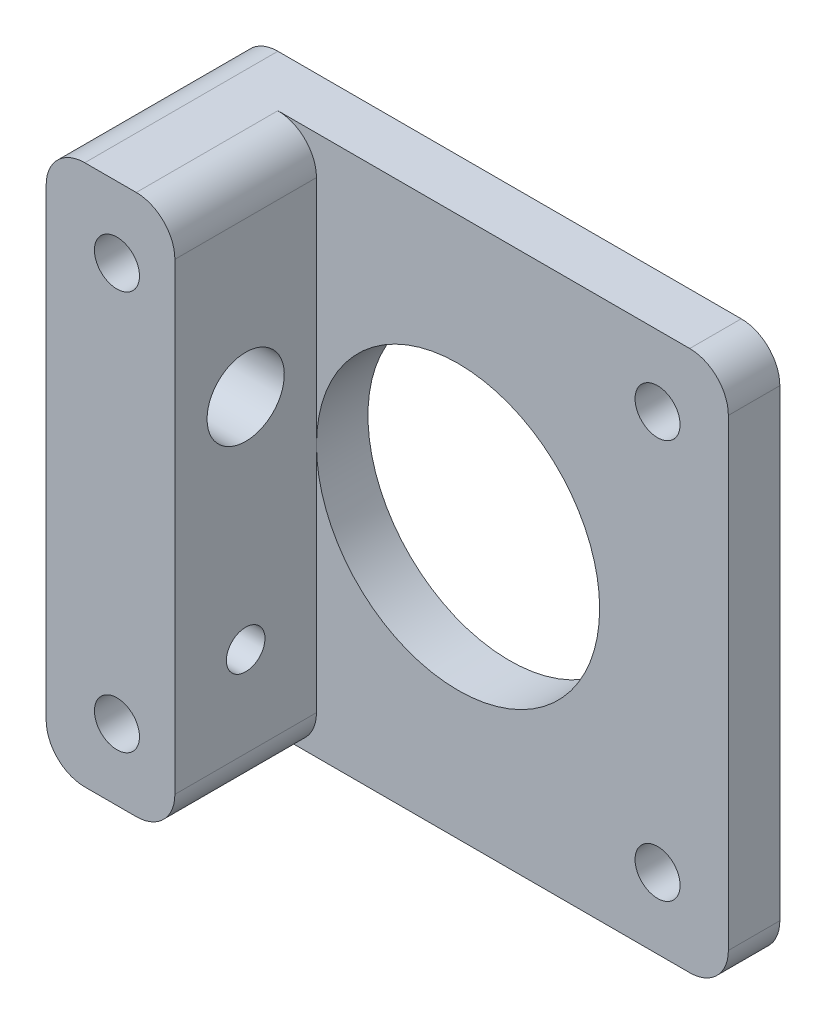
ISO-10303-21;
HEADER;
FILE_DESCRIPTION(('STEP AP214'),'2;1');
FILE_NAME('part.step','',(''),(''),'','','');
FILE_SCHEMA(('AUTOMOTIVE_DESIGN { 1 0 10303 214 1 1 1 1 }'));
ENDSEC;
DATA;
#1=APPLICATION_CONTEXT('core data for automotive mechanical design processes');
#2=APPLICATION_PROTOCOL_DEFINITION('international standard','automotive_design',2000,#1);
#3=PRODUCT_CONTEXT('',#1,'mechanical');
#4=PRODUCT('Part','Part','',(#3));
#5=PRODUCT_RELATED_PRODUCT_CATEGORY('part','',(#4));
#6=PRODUCT_DEFINITION_FORMATION('','',#4);
#7=PRODUCT_DEFINITION_CONTEXT('part definition',#1,'design');
#8=PRODUCT_DEFINITION('design','',#6,#7);
#9=PRODUCT_DEFINITION_SHAPE('','',#8);
#10=(LENGTH_UNIT() NAMED_UNIT(*) SI_UNIT(.MILLI.,.METRE.));
#11=(NAMED_UNIT(*) PLANE_ANGLE_UNIT() SI_UNIT($,.RADIAN.));
#12=(NAMED_UNIT(*) SI_UNIT($,.STERADIAN.) SOLID_ANGLE_UNIT());
#13=UNCERTAINTY_MEASURE_WITH_UNIT(LENGTH_MEASURE(1.E-05),#10,'distance_accuracy_value','');
#14=(GEOMETRIC_REPRESENTATION_CONTEXT(3) GLOBAL_UNCERTAINTY_ASSIGNED_CONTEXT((#13)) GLOBAL_UNIT_ASSIGNED_CONTEXT((#10,
#11,#12)) REPRESENTATION_CONTEXT('',''));
#15=CARTESIAN_POINT('',(0.,0.,0.));
#16=DIRECTION('',(0.,0.,1.));
#17=DIRECTION('',(1.,0.,0.));
#18=AXIS2_PLACEMENT_3D('',#15,#16,#17);
#19=CARTESIAN_POINT('',(21.,21.,4.));
#20=DIRECTION('',(-1.,0.,0.));
#21=DIRECTION('',(0.,-1.,0.));
#22=AXIS2_PLACEMENT_3D('',#19,#20,#21);
#23=PLANE('',#22);
#24=DIRECTION('',(0.,1.,0.));
#25=VECTOR('',#24,1.);
#26=CARTESIAN_POINT('',(21.,21.,0.));
#27=LINE('',#26,#25);
#28=CARTESIAN_POINT('',(21.,-18.,0.));
#29=VERTEX_POINT('',#28);
#30=CARTESIAN_POINT('',(21.,18.,0.));
#31=VERTEX_POINT('',#30);
#32=EDGE_CURVE('E166',#29,#31,#27,.T.);
#33=ORIENTED_EDGE('',*,*,#32,.T.);
#34=DIRECTION('',(0.,0.,-1.));
#35=VECTOR('',#34,1.);
#36=CARTESIAN_POINT('',(21.,18.,4.));
#37=LINE('',#36,#35);
#38=CARTESIAN_POINT('',(21.,18.,4.));
#39=VERTEX_POINT('',#38);
#40=EDGE_CURVE('E50',#31,#39,#37,.F.);
#41=ORIENTED_EDGE('',*,*,#40,.T.);
#42=DIRECTION('',(0.,1.,0.));
#43=VECTOR('',#42,1.);
#44=CARTESIAN_POINT('',(21.,21.,4.));
#45=LINE('',#44,#43);
#46=CARTESIAN_POINT('',(21.,-18.,4.));
#47=VERTEX_POINT('',#46);
#48=EDGE_CURVE('E168',#47,#39,#45,.T.);
#49=ORIENTED_EDGE('',*,*,#48,.F.);
#50=DIRECTION('',(0.,0.,-1.));
#51=VECTOR('',#50,1.);
#52=CARTESIAN_POINT('',(21.,-18.,4.));
#53=LINE('',#52,#51);
#54=EDGE_CURVE('E218',#47,#29,#53,.T.);
#55=ORIENTED_EDGE('',*,*,#54,.T.);
#56=EDGE_LOOP('',(#33,#41,#49,#55));
#57=FACE_BOUND('',#56,.T.);
#58=ADVANCED_FACE('F33',(#57),#23,.F.);
#59=CARTESIAN_POINT('',(-21.,21.,4.));
#60=DIRECTION('',(0.,-1.,0.));
#61=DIRECTION('',(0.,0.,-1.));
#62=AXIS2_PLACEMENT_3D('',#59,#60,#61);
#63=PLANE('',#62);
#64=DIRECTION('',(-1.,0.,0.));
#65=VECTOR('',#64,1.);
#66=CARTESIAN_POINT('',(-21.,21.,15.));
#67=LINE('',#66,#65);
#68=CARTESIAN_POINT('',(-14.,21.,15.));
#69=VERTEX_POINT('',#68);
#70=CARTESIAN_POINT('',(-18.,21.,15.));
#71=VERTEX_POINT('',#70);
#72=EDGE_CURVE('E164',#69,#71,#67,.T.);
#73=ORIENTED_EDGE('',*,*,#72,.F.);
#74=DIRECTION('',(0.,0.,-1.));
#75=VECTOR('',#74,1.);
#76=CARTESIAN_POINT('',(-14.,21.,4.));
#77=LINE('',#76,#75);
#78=CARTESIAN_POINT('',(-14.,21.,4.));
#79=VERTEX_POINT('',#78);
#80=EDGE_CURVE('E189',#69,#79,#77,.T.);
#81=ORIENTED_EDGE('',*,*,#80,.T.);
#82=DIRECTION('',(-1.,0.,0.));
#83=VECTOR('',#82,1.);
#84=CARTESIAN_POINT('',(-21.,21.,4.));
#85=LINE('',#84,#83);
#86=CARTESIAN_POINT('',(18.,21.,4.));
#87=VERTEX_POINT('',#86);
#88=EDGE_CURVE('E170',#87,#79,#85,.T.);
#89=ORIENTED_EDGE('',*,*,#88,.F.);
#90=DIRECTION('',(0.,0.,-1.));
#91=VECTOR('',#90,1.);
#92=CARTESIAN_POINT('',(18.,21.,4.));
#93=LINE('',#92,#91);
#94=CARTESIAN_POINT('',(18.,21.,0.));
#95=VERTEX_POINT('',#94);
#96=EDGE_CURVE('E186',#87,#95,#93,.T.);
#97=ORIENTED_EDGE('',*,*,#96,.T.);
#98=DIRECTION('',(-1.,0.,0.));
#99=VECTOR('',#98,1.);
#100=CARTESIAN_POINT('',(-21.,21.,0.));
#101=LINE('',#100,#99);
#102=CARTESIAN_POINT('',(-18.,21.,0.));
#103=VERTEX_POINT('',#102);
#104=EDGE_CURVE('E177',#95,#103,#101,.T.);
#105=ORIENTED_EDGE('',*,*,#104,.T.);
#106=DIRECTION('',(0.,0.,-1.));
#107=VECTOR('',#106,1.);
#108=CARTESIAN_POINT('',(-18.,21.,4.));
#109=LINE('',#108,#107);
#110=EDGE_CURVE('E175',#103,#71,#109,.F.);
#111=ORIENTED_EDGE('',*,*,#110,.T.);
#112=EDGE_LOOP('',(#73,#81,#89,#97,#105,#111));
#113=FACE_BOUND('',#112,.T.);
#114=ADVANCED_FACE('F282',(#113),#63,.F.);
#115=CARTESIAN_POINT('',(-21.,21.,4.));
#116=DIRECTION('',(1.,0.,0.));
#117=DIRECTION('',(0.,0.,-1.));
#118=AXIS2_PLACEMENT_3D('',#115,#116,#117);
#119=PLANE('',#118);
#120=CARTESIAN_POINT('',(-21.,6.00000000000001,9.5));
#121=DIRECTION('',(-1.,0.,0.));
#122=DIRECTION('',(0.,0.,1.));
#123=AXIS2_PLACEMENT_3D('',#120,#121,#122);
#124=CIRCLE('',#123,3.);
#125=CARTESIAN_POINT('',(-21.,6.00000000000001,12.5));
#126=VERTEX_POINT('',#125);
#127=EDGE_CURVE('E239',#126,#126,#124,.T.);
#128=ORIENTED_EDGE('',*,*,#127,.F.);
#129=EDGE_LOOP('',(#128));
#130=FACE_BOUND('',#129,.T.);
#131=CARTESIAN_POINT('',(-21.,-11.,9.5));
#132=DIRECTION('',(-1.,0.,0.));
#133=DIRECTION('',(0.,0.,1.));
#134=AXIS2_PLACEMENT_3D('',#131,#132,#133);
#135=CIRCLE('',#134,1.5);
#136=CARTESIAN_POINT('',(-21.,-11.,11.));
#137=VERTEX_POINT('',#136);
#138=EDGE_CURVE('E245',#137,#137,#135,.T.);
#139=ORIENTED_EDGE('',*,*,#138,.F.);
#140=EDGE_LOOP('',(#139));
#141=FACE_BOUND('',#140,.T.);
#142=DIRECTION('',(0.,-1.,0.));
#143=VECTOR('',#142,1.);
#144=CARTESIAN_POINT('',(-21.,21.,15.));
#145=LINE('',#144,#143);
#146=CARTESIAN_POINT('',(-21.,18.,15.));
#147=VERTEX_POINT('',#146);
#148=CARTESIAN_POINT('',(-21.,-18.,15.));
#149=VERTEX_POINT('',#148);
#150=EDGE_CURVE('E140',#147,#149,#145,.T.);
#151=ORIENTED_EDGE('',*,*,#150,.F.);
#152=DIRECTION('',(0.,0.,-1.));
#153=VECTOR('',#152,1.);
#154=CARTESIAN_POINT('',(-21.,18.,4.));
#155=LINE('',#154,#153);
#156=CARTESIAN_POINT('',(-21.,18.,0.));
#157=VERTEX_POINT('',#156);
#158=EDGE_CURVE('E227',#147,#157,#155,.T.);
#159=ORIENTED_EDGE('',*,*,#158,.T.);
#160=DIRECTION('',(0.,-1.,0.));
#161=VECTOR('',#160,1.);
#162=CARTESIAN_POINT('',(-21.,21.,0.));
#163=LINE('',#162,#161);
#164=CARTESIAN_POINT('',(-21.,-18.,0.));
#165=VERTEX_POINT('',#164);
#166=EDGE_CURVE('E180',#157,#165,#163,.T.);
#167=ORIENTED_EDGE('',*,*,#166,.T.);
#168=DIRECTION('',(0.,0.,-1.));
#169=VECTOR('',#168,1.);
#170=CARTESIAN_POINT('',(-21.,-18.,4.));
#171=LINE('',#170,#169);
#172=EDGE_CURVE('E225',#165,#149,#171,.F.);
#173=ORIENTED_EDGE('',*,*,#172,.T.);
#174=EDGE_LOOP('',(#151,#159,#167,#173));
#175=FACE_BOUND('',#174,.T.);
#176=ADVANCED_FACE('F293',(#130,#141,#175),#119,.F.);
#177=CARTESIAN_POINT('',(-21.,-21.,4.));
#178=DIRECTION('',(0.,1.,0.));
#179=DIRECTION('',(0.,0.,1.));
#180=AXIS2_PLACEMENT_3D('',#177,#178,#179);
#181=PLANE('',#180);
#182=DIRECTION('',(1.,0.,0.));
#183=VECTOR('',#182,1.);
#184=CARTESIAN_POINT('',(-21.,-21.,4.));
#185=LINE('',#184,#183);
#186=CARTESIAN_POINT('',(-14.,-21.,4.));
#187=VERTEX_POINT('',#186);
#188=CARTESIAN_POINT('',(18.,-21.,4.));
#189=VERTEX_POINT('',#188);
#190=EDGE_CURVE('E173',#187,#189,#185,.T.);
#191=ORIENTED_EDGE('',*,*,#190,.F.);
#192=DIRECTION('',(0.,0.,-1.));
#193=VECTOR('',#192,1.);
#194=CARTESIAN_POINT('',(-14.,-21.,4.));
#195=LINE('',#194,#193);
#196=CARTESIAN_POINT('',(-14.,-21.,15.));
#197=VERTEX_POINT('',#196);
#198=EDGE_CURVE('E208',#187,#197,#195,.F.);
#199=ORIENTED_EDGE('',*,*,#198,.T.);
#200=DIRECTION('',(1.,0.,0.));
#201=VECTOR('',#200,1.);
#202=CARTESIAN_POINT('',(-21.,-21.,15.));
#203=LINE('',#202,#201);
#204=CARTESIAN_POINT('',(-18.,-21.,15.));
#205=VERTEX_POINT('',#204);
#206=EDGE_CURVE('E158',#205,#197,#203,.T.);
#207=ORIENTED_EDGE('',*,*,#206,.F.);
#208=DIRECTION('',(0.,0.,-1.));
#209=VECTOR('',#208,1.);
#210=CARTESIAN_POINT('',(-18.,-21.,4.));
#211=LINE('',#210,#209);
#212=CARTESIAN_POINT('',(-18.,-21.,0.));
#213=VERTEX_POINT('',#212);
#214=EDGE_CURVE('E203',#205,#213,#211,.T.);
#215=ORIENTED_EDGE('',*,*,#214,.T.);
#216=DIRECTION('',(1.,0.,0.));
#217=VECTOR('',#216,1.);
#218=CARTESIAN_POINT('',(-21.,-21.,0.));
#219=LINE('',#218,#217);
#220=CARTESIAN_POINT('',(18.,-21.,0.));
#221=VERTEX_POINT('',#220);
#222=EDGE_CURVE('E171',#213,#221,#219,.T.);
#223=ORIENTED_EDGE('',*,*,#222,.T.);
#224=DIRECTION('',(0.,0.,-1.));
#225=VECTOR('',#224,1.);
#226=CARTESIAN_POINT('',(18.,-21.,4.));
#227=LINE('',#226,#225);
#228=EDGE_CURVE('E206',#221,#189,#227,.F.);
#229=ORIENTED_EDGE('',*,*,#228,.T.);
#230=EDGE_LOOP('',(#191,#199,#207,#215,#223,#229));
#231=FACE_BOUND('',#230,.T.);
#232=ADVANCED_FACE('F270',(#231),#181,.F.);
#233=CARTESIAN_POINT('',(0.,0.,4.));
#234=DIRECTION('',(0.,0.,1.));
#235=DIRECTION('',(1.,0.,0.));
#236=AXIS2_PLACEMENT_3D('',#233,#234,#235);
#237=PLANE('',#236);
#238=CARTESIAN_POINT('',(15.5,15.5,4.));
#239=DIRECTION('',(0.,0.,1.));
#240=DIRECTION('',(1.,0.,0.));
#241=AXIS2_PLACEMENT_3D('',#238,#239,#240);
#242=CIRCLE('',#241,1.75);
#243=CARTESIAN_POINT('',(17.25,15.5,4.));
#244=VERTEX_POINT('',#243);
#245=EDGE_CURVE('E147',#244,#244,#242,.T.);
#246=ORIENTED_EDGE('',*,*,#245,.F.);
#247=EDGE_LOOP('',(#246));
#248=FACE_BOUND('',#247,.T.);
#249=CARTESIAN_POINT('',(15.5,-15.5,4.));
#250=DIRECTION('',(0.,0.,1.));
#251=DIRECTION('',(1.,0.,0.));
#252=AXIS2_PLACEMENT_3D('',#249,#250,#251);
#253=CIRCLE('',#252,1.75);
#254=CARTESIAN_POINT('',(17.25,-15.5,4.));
#255=VERTEX_POINT('',#254);
#256=EDGE_CURVE('E234',#255,#255,#253,.T.);
#257=ORIENTED_EDGE('',*,*,#256,.F.);
#258=EDGE_LOOP('',(#257));
#259=FACE_BOUND('',#258,.T.);
#260=ORIENTED_EDGE('',*,*,#48,.T.);
#261=CARTESIAN_POINT('',(18.,18.,4.));
#262=DIRECTION('',(0.,0.,1.));
#263=DIRECTION('',(1.,0.,0.));
#264=AXIS2_PLACEMENT_3D('',#261,#262,#263);
#265=CIRCLE('',#264,3.);
#266=EDGE_CURVE('E223',#39,#87,#265,.T.);
#267=ORIENTED_EDGE('',*,*,#266,.T.);
#268=ORIENTED_EDGE('',*,*,#88,.T.);
#269=CARTESIAN_POINT('',(-14.,18.,4.));
#270=DIRECTION('',(0.,0.,1.));
#271=DIRECTION('',(1.,0.,0.));
#272=AXIS2_PLACEMENT_3D('',#269,#270,#271);
#273=CIRCLE('',#272,3.);
#274=CARTESIAN_POINT('',(-11.,18.,4.));
#275=VERTEX_POINT('',#274);
#276=EDGE_CURVE('E42',#79,#275,#273,.F.);
#277=ORIENTED_EDGE('',*,*,#276,.T.);
#278=DIRECTION('',(0.,1.,0.));
#279=VECTOR('',#278,1.);
#280=CARTESIAN_POINT('',(-11.,21.,4.));
#281=LINE('',#280,#279);
#282=CARTESIAN_POINT('',(-11.,0.,4.));
#283=VERTEX_POINT('',#282);
#284=EDGE_CURVE('E134',#283,#275,#281,.T.);
#285=ORIENTED_EDGE('',*,*,#284,.F.);
#286=CARTESIAN_POINT('',(0.,0.,4.));
#287=DIRECTION('',(0.,0.,1.));
#288=DIRECTION('',(1.,0.,0.));
#289=AXIS2_PLACEMENT_3D('',#286,#287,#288);
#290=CIRCLE('',#289,11.);
#291=EDGE_CURVE('E143',#283,#283,#290,.T.);
#292=ORIENTED_EDGE('',*,*,#291,.F.);
#293=CARTESIAN_POINT('',(-11.,-18.,4.));
#294=VERTEX_POINT('',#293);
#295=EDGE_CURVE('E130',#294,#283,#281,.T.);
#296=ORIENTED_EDGE('',*,*,#295,.F.);
#297=CARTESIAN_POINT('',(-14.,-18.,4.));
#298=DIRECTION('',(0.,0.,1.));
#299=DIRECTION('',(1.,0.,0.));
#300=AXIS2_PLACEMENT_3D('',#297,#298,#299);
#301=CIRCLE('',#300,3.);
#302=EDGE_CURVE('E11',#294,#187,#301,.F.);
#303=ORIENTED_EDGE('',*,*,#302,.T.);
#304=ORIENTED_EDGE('',*,*,#190,.T.);
#305=CARTESIAN_POINT('',(18.,-18.,4.));
#306=DIRECTION('',(0.,0.,1.));
#307=DIRECTION('',(1.,0.,0.));
#308=AXIS2_PLACEMENT_3D('',#305,#306,#307);
#309=CIRCLE('',#308,3.);
#310=EDGE_CURVE('E57',#189,#47,#309,.T.);
#311=ORIENTED_EDGE('',*,*,#310,.T.);
#312=EDGE_LOOP('',(#260,#267,#268,#277,#285,#292,#296,#303,#304,#311));
#313=FACE_BOUND('',#312,.T.);
#314=ADVANCED_FACE('F267',(#248,#259,#313),#237,.T.);
#315=CARTESIAN_POINT('',(0.,0.,0.));
#316=DIRECTION('',(0.,0.,1.));
#317=DIRECTION('',(1.,0.,0.));
#318=AXIS2_PLACEMENT_3D('',#315,#316,#317);
#319=PLANE('',#318);
#320=CARTESIAN_POINT('',(-15.5,-15.5,0.));
#321=DIRECTION('',(0.,0.,1.));
#322=DIRECTION('',(1.,0.,0.));
#323=AXIS2_PLACEMENT_3D('',#320,#321,#322);
#324=CIRCLE('',#323,1.75);
#325=CARTESIAN_POINT('',(-13.75,-15.5,0.));
#326=VERTEX_POINT('',#325);
#327=EDGE_CURVE('E235',#326,#326,#324,.T.);
#328=ORIENTED_EDGE('',*,*,#327,.T.);
#329=EDGE_LOOP('',(#328));
#330=FACE_BOUND('',#329,.T.);
#331=CARTESIAN_POINT('',(15.5,15.5,0.));
#332=DIRECTION('',(0.,0.,1.));
#333=DIRECTION('',(1.,0.,0.));
#334=AXIS2_PLACEMENT_3D('',#331,#332,#333);
#335=CIRCLE('',#334,1.75);
#336=CARTESIAN_POINT('',(17.25,15.5,0.));
#337=VERTEX_POINT('',#336);
#338=EDGE_CURVE('E152',#337,#337,#335,.T.);
#339=ORIENTED_EDGE('',*,*,#338,.T.);
#340=EDGE_LOOP('',(#339));
#341=FACE_BOUND('',#340,.T.);
#342=CARTESIAN_POINT('',(15.5,-15.5,0.));
#343=DIRECTION('',(0.,0.,1.));
#344=DIRECTION('',(1.,0.,0.));
#345=AXIS2_PLACEMENT_3D('',#342,#343,#344);
#346=CIRCLE('',#345,1.75);
#347=CARTESIAN_POINT('',(17.25,-15.5,0.));
#348=VERTEX_POINT('',#347);
#349=EDGE_CURVE('E231',#348,#348,#346,.T.);
#350=ORIENTED_EDGE('',*,*,#349,.T.);
#351=EDGE_LOOP('',(#350));
#352=FACE_BOUND('',#351,.T.);
#353=CARTESIAN_POINT('',(-15.5,15.5,0.));
#354=DIRECTION('',(0.,0.,1.));
#355=DIRECTION('',(1.,0.,0.));
#356=AXIS2_PLACEMENT_3D('',#353,#354,#355);
#357=CIRCLE('',#356,1.75);
#358=CARTESIAN_POINT('',(-13.75,15.5,0.));
#359=VERTEX_POINT('',#358);
#360=EDGE_CURVE('E257',#359,#359,#357,.T.);
#361=ORIENTED_EDGE('',*,*,#360,.T.);
#362=EDGE_LOOP('',(#361));
#363=FACE_BOUND('',#362,.T.);
#364=CARTESIAN_POINT('',(0.,0.,0.));
#365=DIRECTION('',(0.,0.,1.));
#366=DIRECTION('',(1.,0.,0.));
#367=AXIS2_PLACEMENT_3D('',#364,#365,#366);
#368=CIRCLE('',#367,11.);
#369=CARTESIAN_POINT('',(11.,0.,0.));
#370=VERTEX_POINT('',#369);
#371=EDGE_CURVE('E146',#370,#370,#368,.T.);
#372=ORIENTED_EDGE('',*,*,#371,.T.);
#373=EDGE_LOOP('',(#372));
#374=FACE_BOUND('',#373,.T.);
#375=ORIENTED_EDGE('',*,*,#104,.F.);
#376=CARTESIAN_POINT('',(18.,18.,0.));
#377=DIRECTION('',(0.,0.,1.));
#378=DIRECTION('',(1.,0.,0.));
#379=AXIS2_PLACEMENT_3D('',#376,#377,#378);
#380=CIRCLE('',#379,3.);
#381=EDGE_CURVE('E216',#95,#31,#380,.F.);
#382=ORIENTED_EDGE('',*,*,#381,.T.);
#383=ORIENTED_EDGE('',*,*,#32,.F.);
#384=CARTESIAN_POINT('',(18.,-18.,0.));
#385=DIRECTION('',(0.,0.,1.));
#386=DIRECTION('',(1.,0.,0.));
#387=AXIS2_PLACEMENT_3D('',#384,#385,#386);
#388=CIRCLE('',#387,3.);
#389=EDGE_CURVE('E212',#29,#221,#388,.F.);
#390=ORIENTED_EDGE('',*,*,#389,.T.);
#391=ORIENTED_EDGE('',*,*,#222,.F.);
#392=CARTESIAN_POINT('',(-18.,-18.,0.));
#393=DIRECTION('',(0.,0.,1.));
#394=DIRECTION('',(1.,0.,0.));
#395=AXIS2_PLACEMENT_3D('',#392,#393,#394);
#396=CIRCLE('',#395,3.);
#397=EDGE_CURVE('E210',#213,#165,#396,.F.);
#398=ORIENTED_EDGE('',*,*,#397,.T.);
#399=ORIENTED_EDGE('',*,*,#166,.F.);
#400=CARTESIAN_POINT('',(-18.,18.,0.));
#401=DIRECTION('',(0.,0.,1.));
#402=DIRECTION('',(1.,0.,0.));
#403=AXIS2_PLACEMENT_3D('',#400,#401,#402);
#404=CIRCLE('',#403,3.);
#405=EDGE_CURVE('E214',#157,#103,#404,.F.);
#406=ORIENTED_EDGE('',*,*,#405,.T.);
#407=EDGE_LOOP('',(#375,#382,#383,#390,#391,#398,#399,#406));
#408=FACE_BOUND('',#407,.T.);
#409=ADVANCED_FACE('F269',(#330,#341,#352,#363,#374,#408),#319,.F.);
#410=CARTESIAN_POINT('',(-11.,21.,15.));
#411=DIRECTION('',(-1.,0.,0.));
#412=DIRECTION('',(0.,-1.,0.));
#413=AXIS2_PLACEMENT_3D('',#410,#411,#412);
#414=PLANE('',#413);
#415=CARTESIAN_POINT('',(-11.,6.00000000000001,9.5));
#416=DIRECTION('',(-1.,0.,0.));
#417=DIRECTION('',(0.,-1.,0.));
#418=AXIS2_PLACEMENT_3D('',#415,#416,#417);
#419=CIRCLE('',#418,3.);
#420=CARTESIAN_POINT('',(-11.,3.,9.5));
#421=VERTEX_POINT('',#420);
#422=EDGE_CURVE('E37',#421,#421,#419,.T.);
#423=ORIENTED_EDGE('',*,*,#422,.T.);
#424=EDGE_LOOP('',(#423));
#425=FACE_BOUND('',#424,.T.);
#426=CARTESIAN_POINT('',(-11.,-11.,9.5));
#427=DIRECTION('',(-1.,0.,0.));
#428=DIRECTION('',(0.,-1.,0.));
#429=AXIS2_PLACEMENT_3D('',#426,#427,#428);
#430=CIRCLE('',#429,1.5);
#431=CARTESIAN_POINT('',(-11.,-12.5,9.5));
#432=VERTEX_POINT('',#431);
#433=EDGE_CURVE('E237',#432,#432,#430,.T.);
#434=ORIENTED_EDGE('',*,*,#433,.T.);
#435=EDGE_LOOP('',(#434));
#436=FACE_BOUND('',#435,.T.);
#437=ORIENTED_EDGE('',*,*,#284,.T.);
#438=DIRECTION('',(0.,0.,-1.));
#439=VECTOR('',#438,1.);
#440=CARTESIAN_POINT('',(-11.,18.,15.));
#441=LINE('',#440,#439);
#442=CARTESIAN_POINT('',(-11.,18.,15.));
#443=VERTEX_POINT('',#442);
#444=EDGE_CURVE('E193',#275,#443,#441,.F.);
#445=ORIENTED_EDGE('',*,*,#444,.T.);
#446=DIRECTION('',(0.,1.,0.));
#447=VECTOR('',#446,1.);
#448=CARTESIAN_POINT('',(-11.,21.,15.));
#449=LINE('',#448,#447);
#450=CARTESIAN_POINT('',(-11.,-18.,15.));
#451=VERTEX_POINT('',#450);
#452=EDGE_CURVE('E161',#451,#443,#449,.T.);
#453=ORIENTED_EDGE('',*,*,#452,.F.);
#454=DIRECTION('',(0.,0.,-1.));
#455=VECTOR('',#454,1.);
#456=CARTESIAN_POINT('',(-11.,-18.,15.));
#457=LINE('',#456,#455);
#458=EDGE_CURVE('E138',#451,#294,#457,.T.);
#459=ORIENTED_EDGE('',*,*,#458,.T.);
#460=ORIENTED_EDGE('',*,*,#295,.T.);
#461=EDGE_LOOP('',(#437,#445,#453,#459,#460));
#462=FACE_BOUND('',#461,.T.);
#463=ADVANCED_FACE('F132',(#425,#436,#462),#414,.F.);
#464=CARTESIAN_POINT('',(0.,0.,15.));
#465=DIRECTION('',(0.,0.,1.));
#466=DIRECTION('',(1.,0.,0.));
#467=AXIS2_PLACEMENT_3D('',#464,#465,#466);
#468=PLANE('',#467);
#469=CARTESIAN_POINT('',(-15.5,-15.5,15.));
#470=DIRECTION('',(0.,0.,1.));
#471=DIRECTION('',(1.,0.,0.));
#472=AXIS2_PLACEMENT_3D('',#469,#470,#471);
#473=CIRCLE('',#472,1.75);
#474=CARTESIAN_POINT('',(-13.75,-15.5,15.));
#475=VERTEX_POINT('',#474);
#476=EDGE_CURVE('E243',#475,#475,#473,.T.);
#477=ORIENTED_EDGE('',*,*,#476,.F.);
#478=EDGE_LOOP('',(#477));
#479=FACE_BOUND('',#478,.T.);
#480=CARTESIAN_POINT('',(-15.5,15.5,15.));
#481=DIRECTION('',(0.,0.,1.));
#482=DIRECTION('',(1.,0.,0.));
#483=AXIS2_PLACEMENT_3D('',#480,#481,#482);
#484=CIRCLE('',#483,1.75);
#485=CARTESIAN_POINT('',(-13.75,15.5,15.));
#486=VERTEX_POINT('',#485);
#487=EDGE_CURVE('E254',#486,#486,#484,.T.);
#488=ORIENTED_EDGE('',*,*,#487,.F.);
#489=EDGE_LOOP('',(#488));
#490=FACE_BOUND('',#489,.T.);
#491=ORIENTED_EDGE('',*,*,#452,.T.);
#492=CARTESIAN_POINT('',(-14.,18.,15.));
#493=DIRECTION('',(0.,0.,1.));
#494=DIRECTION('',(1.,0.,0.));
#495=AXIS2_PLACEMENT_3D('',#492,#493,#494);
#496=CIRCLE('',#495,3.);
#497=EDGE_CURVE('E201',#443,#69,#496,.T.);
#498=ORIENTED_EDGE('',*,*,#497,.T.);
#499=ORIENTED_EDGE('',*,*,#72,.T.);
#500=CARTESIAN_POINT('',(-18.,18.,15.));
#501=DIRECTION('',(0.,0.,1.));
#502=DIRECTION('',(1.,0.,0.));
#503=AXIS2_PLACEMENT_3D('',#500,#501,#502);
#504=CIRCLE('',#503,3.);
#505=EDGE_CURVE('E197',#71,#147,#504,.T.);
#506=ORIENTED_EDGE('',*,*,#505,.T.);
#507=ORIENTED_EDGE('',*,*,#150,.T.);
#508=CARTESIAN_POINT('',(-18.,-18.,15.));
#509=DIRECTION('',(0.,0.,1.));
#510=DIRECTION('',(1.,0.,0.));
#511=AXIS2_PLACEMENT_3D('',#508,#509,#510);
#512=CIRCLE('',#511,3.);
#513=EDGE_CURVE('E195',#149,#205,#512,.T.);
#514=ORIENTED_EDGE('',*,*,#513,.T.);
#515=ORIENTED_EDGE('',*,*,#206,.T.);
#516=CARTESIAN_POINT('',(-14.,-18.,15.));
#517=DIRECTION('',(0.,0.,1.));
#518=DIRECTION('',(1.,0.,0.));
#519=AXIS2_PLACEMENT_3D('',#516,#517,#518);
#520=CIRCLE('',#519,3.);
#521=EDGE_CURVE('E199',#197,#451,#520,.T.);
#522=ORIENTED_EDGE('',*,*,#521,.T.);
#523=EDGE_LOOP('',(#491,#498,#499,#506,#507,#514,#515,#522));
#524=FACE_BOUND('',#523,.T.);
#525=ADVANCED_FACE('F297',(#479,#490,#524),#468,.T.);
#526=CARTESIAN_POINT('',(0.,0.,-7.));
#527=DIRECTION('',(0.,0.,1.));
#528=DIRECTION('',(1.,0.,0.));
#529=AXIS2_PLACEMENT_3D('',#526,#527,#528);
#530=CYLINDRICAL_SURFACE('',#529,11.);
#531=ORIENTED_EDGE('',*,*,#291,.T.);
#532=EDGE_LOOP('',(#531));
#533=FACE_BOUND('',#532,.T.);
#534=ORIENTED_EDGE('',*,*,#371,.F.);
#535=EDGE_LOOP('',(#534));
#536=FACE_BOUND('',#535,.T.);
#537=ADVANCED_FACE('F144',(#533,#536),#530,.F.);
#538=CARTESIAN_POINT('',(-14.,18.,4.));
#539=DIRECTION('',(0.,0.,-1.));
#540=DIRECTION('',(-1.,0.,0.));
#541=AXIS2_PLACEMENT_3D('',#538,#539,#540);
#542=CYLINDRICAL_SURFACE('',#541,3.);
#543=ORIENTED_EDGE('',*,*,#497,.F.);
#544=ORIENTED_EDGE('',*,*,#444,.F.);
#545=ORIENTED_EDGE('',*,*,#276,.F.);
#546=ORIENTED_EDGE('',*,*,#80,.F.);
#547=EDGE_LOOP('',(#543,#544,#545,#546));
#548=FACE_BOUND('',#547,.T.);
#549=ADVANCED_FACE('F314',(#548),#542,.T.);
#550=CARTESIAN_POINT('',(-14.,-18.,15.));
#551=DIRECTION('',(0.,0.,-1.));
#552=DIRECTION('',(-1.,0.,0.));
#553=AXIS2_PLACEMENT_3D('',#550,#551,#552);
#554=CYLINDRICAL_SURFACE('',#553,3.);
#555=ORIENTED_EDGE('',*,*,#521,.F.);
#556=ORIENTED_EDGE('',*,*,#198,.F.);
#557=ORIENTED_EDGE('',*,*,#302,.F.);
#558=ORIENTED_EDGE('',*,*,#458,.F.);
#559=EDGE_LOOP('',(#555,#556,#557,#558));
#560=FACE_BOUND('',#559,.T.);
#561=ADVANCED_FACE('F317',(#560),#554,.T.);
#562=CARTESIAN_POINT('',(18.,18.,4.));
#563=DIRECTION('',(0.,0.,-1.));
#564=DIRECTION('',(-1.,0.,0.));
#565=AXIS2_PLACEMENT_3D('',#562,#563,#564);
#566=CYLINDRICAL_SURFACE('',#565,3.);
#567=ORIENTED_EDGE('',*,*,#266,.F.);
#568=ORIENTED_EDGE('',*,*,#40,.F.);
#569=ORIENTED_EDGE('',*,*,#381,.F.);
#570=ORIENTED_EDGE('',*,*,#96,.F.);
#571=EDGE_LOOP('',(#567,#568,#569,#570));
#572=FACE_BOUND('',#571,.T.);
#573=ADVANCED_FACE('F278',(#572),#566,.T.);
#574=CARTESIAN_POINT('',(-18.,18.,4.));
#575=DIRECTION('',(0.,0.,-1.));
#576=DIRECTION('',(-1.,0.,0.));
#577=AXIS2_PLACEMENT_3D('',#574,#575,#576);
#578=CYLINDRICAL_SURFACE('',#577,3.);
#579=ORIENTED_EDGE('',*,*,#505,.F.);
#580=ORIENTED_EDGE('',*,*,#110,.F.);
#581=ORIENTED_EDGE('',*,*,#405,.F.);
#582=ORIENTED_EDGE('',*,*,#158,.F.);
#583=EDGE_LOOP('',(#579,#580,#581,#582));
#584=FACE_BOUND('',#583,.T.);
#585=ADVANCED_FACE('F290',(#584),#578,.T.);
#586=CARTESIAN_POINT('',(18.,-18.,4.));
#587=DIRECTION('',(0.,0.,-1.));
#588=DIRECTION('',(-1.,0.,0.));
#589=AXIS2_PLACEMENT_3D('',#586,#587,#588);
#590=CYLINDRICAL_SURFACE('',#589,3.);
#591=ORIENTED_EDGE('',*,*,#310,.F.);
#592=ORIENTED_EDGE('',*,*,#228,.F.);
#593=ORIENTED_EDGE('',*,*,#389,.F.);
#594=ORIENTED_EDGE('',*,*,#54,.F.);
#595=EDGE_LOOP('',(#591,#592,#593,#594));
#596=FACE_BOUND('',#595,.T.);
#597=ADVANCED_FACE('F305',(#596),#590,.T.);
#598=CARTESIAN_POINT('',(-18.,-18.,4.));
#599=DIRECTION('',(0.,0.,-1.));
#600=DIRECTION('',(-1.,0.,0.));
#601=AXIS2_PLACEMENT_3D('',#598,#599,#600);
#602=CYLINDRICAL_SURFACE('',#601,3.);
#603=ORIENTED_EDGE('',*,*,#513,.F.);
#604=ORIENTED_EDGE('',*,*,#172,.F.);
#605=ORIENTED_EDGE('',*,*,#397,.F.);
#606=ORIENTED_EDGE('',*,*,#214,.F.);
#607=EDGE_LOOP('',(#603,#604,#605,#606));
#608=FACE_BOUND('',#607,.T.);
#609=ADVANCED_FACE('F35',(#608),#602,.T.);
#610=CARTESIAN_POINT('',(-15.5,15.5,-6.));
#611=DIRECTION('',(0.,0.,1.));
#612=DIRECTION('',(1.,0.,0.));
#613=AXIS2_PLACEMENT_3D('',#610,#611,#612);
#614=CYLINDRICAL_SURFACE('',#613,1.75);
#615=ORIENTED_EDGE('',*,*,#487,.T.);
#616=EDGE_LOOP('',(#615));
#617=FACE_BOUND('',#616,.T.);
#618=ORIENTED_EDGE('',*,*,#360,.F.);
#619=EDGE_LOOP('',(#618));
#620=FACE_BOUND('',#619,.T.);
#621=ADVANCED_FACE('F329',(#617,#620),#614,.F.);
#622=CARTESIAN_POINT('',(-15.5,-15.5,-6.));
#623=DIRECTION('',(0.,0.,1.));
#624=DIRECTION('',(1.,0.,0.));
#625=AXIS2_PLACEMENT_3D('',#622,#623,#624);
#626=CYLINDRICAL_SURFACE('',#625,1.75);
#627=ORIENTED_EDGE('',*,*,#476,.T.);
#628=EDGE_LOOP('',(#627));
#629=FACE_BOUND('',#628,.T.);
#630=ORIENTED_EDGE('',*,*,#327,.F.);
#631=EDGE_LOOP('',(#630));
#632=FACE_BOUND('',#631,.T.);
#633=ADVANCED_FACE('F333',(#629,#632),#626,.F.);
#634=CARTESIAN_POINT('',(15.5,-15.5,-6.));
#635=DIRECTION('',(0.,0.,1.));
#636=DIRECTION('',(1.,0.,0.));
#637=AXIS2_PLACEMENT_3D('',#634,#635,#636);
#638=CYLINDRICAL_SURFACE('',#637,1.75);
#639=ORIENTED_EDGE('',*,*,#256,.T.);
#640=EDGE_LOOP('',(#639));
#641=FACE_BOUND('',#640,.T.);
#642=ORIENTED_EDGE('',*,*,#349,.F.);
#643=EDGE_LOOP('',(#642));
#644=FACE_BOUND('',#643,.T.);
#645=ADVANCED_FACE('F264',(#641,#644),#638,.F.);
#646=CARTESIAN_POINT('',(15.5,15.5,-6.));
#647=DIRECTION('',(0.,0.,1.));
#648=DIRECTION('',(1.,0.,0.));
#649=AXIS2_PLACEMENT_3D('',#646,#647,#648);
#650=CYLINDRICAL_SURFACE('',#649,1.75);
#651=ORIENTED_EDGE('',*,*,#245,.T.);
#652=EDGE_LOOP('',(#651));
#653=FACE_BOUND('',#652,.T.);
#654=ORIENTED_EDGE('',*,*,#338,.F.);
#655=EDGE_LOOP('',(#654));
#656=FACE_BOUND('',#655,.T.);
#657=ADVANCED_FACE('F344',(#653,#656),#650,.F.);
#658=CARTESIAN_POINT('',(0.,-11.,9.5));
#659=DIRECTION('',(-1.,0.,0.));
#660=DIRECTION('',(0.,0.,1.));
#661=AXIS2_PLACEMENT_3D('',#658,#659,#660);
#662=CYLINDRICAL_SURFACE('',#661,1.5);
#663=ORIENTED_EDGE('',*,*,#138,.T.);
#664=EDGE_LOOP('',(#663));
#665=FACE_BOUND('',#664,.T.);
#666=ORIENTED_EDGE('',*,*,#433,.F.);
#667=EDGE_LOOP('',(#666));
#668=FACE_BOUND('',#667,.T.);
#669=ADVANCED_FACE('F364',(#665,#668),#662,.F.);
#670=CARTESIAN_POINT('',(0.,6.00000000000001,9.5));
#671=DIRECTION('',(-1.,0.,0.));
#672=DIRECTION('',(0.,0.,1.));
#673=AXIS2_PLACEMENT_3D('',#670,#671,#672);
#674=CYLINDRICAL_SURFACE('',#673,3.);
#675=ORIENTED_EDGE('',*,*,#127,.T.);
#676=EDGE_LOOP('',(#675));
#677=FACE_BOUND('',#676,.T.);
#678=ORIENTED_EDGE('',*,*,#422,.F.);
#679=EDGE_LOOP('',(#678));
#680=FACE_BOUND('',#679,.T.);
#681=ADVANCED_FACE('F367',(#677,#680),#674,.F.);
#682=CLOSED_SHELL('',(#58,#114,#176,#232,#314,#409,#463,#525,#537,#549,#561,#573,#585,#597,#609,
#621,#633,#645,#657,#669,#681));
#683=MANIFOLD_SOLID_BREP('B2',#682);
#684=ADVANCED_BREP_SHAPE_REPRESENTATION('',(#18,#683),#14);
#685=SHAPE_DEFINITION_REPRESENTATION(#9,#684);
ENDSEC;
END-ISO-10303-21;
